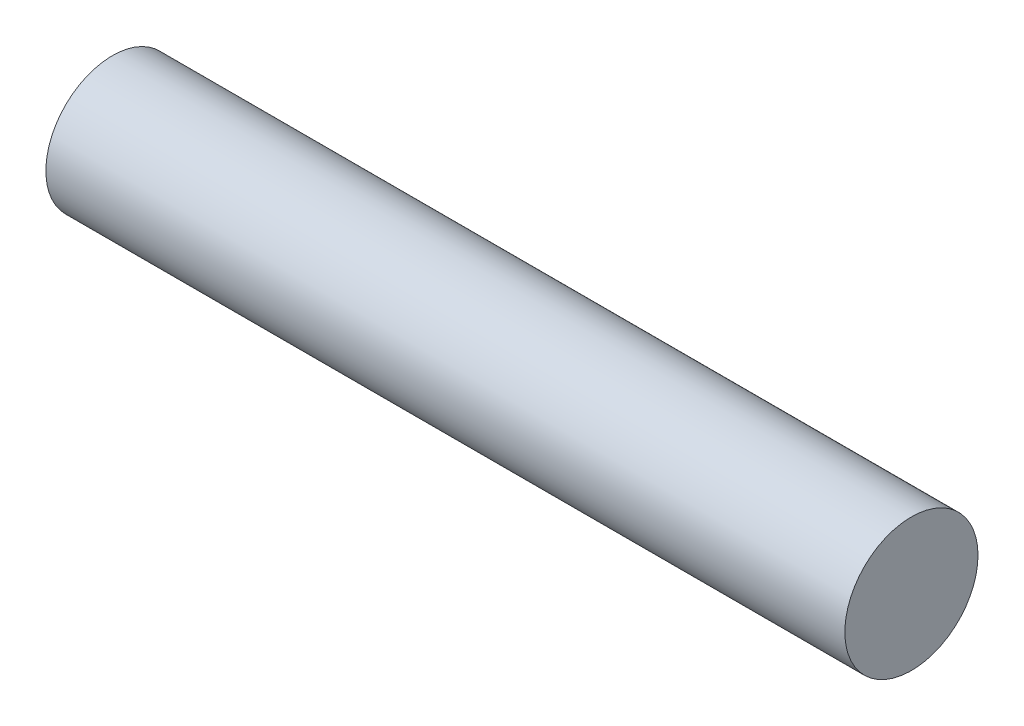
ISO-10303-21;
HEADER;
FILE_DESCRIPTION(('STEP AP214'),'2;1');
FILE_NAME('part.step','',(''),(''),'','','');
FILE_SCHEMA(('AUTOMOTIVE_DESIGN { 1 0 10303 214 1 1 1 1 }'));
ENDSEC;
DATA;
#1=APPLICATION_CONTEXT('core data for automotive mechanical design processes');
#2=APPLICATION_PROTOCOL_DEFINITION('international standard','automotive_design',2000,#1);
#3=PRODUCT_CONTEXT('',#1,'mechanical');
#4=PRODUCT('Part','Part','',(#3));
#5=PRODUCT_RELATED_PRODUCT_CATEGORY('part','',(#4));
#6=PRODUCT_DEFINITION_FORMATION('','',#4);
#7=PRODUCT_DEFINITION_CONTEXT('part definition',#1,'design');
#8=PRODUCT_DEFINITION('design','',#6,#7);
#9=PRODUCT_DEFINITION_SHAPE('','',#8);
#10=(LENGTH_UNIT() NAMED_UNIT(*) SI_UNIT(.MILLI.,.METRE.));
#11=(NAMED_UNIT(*) PLANE_ANGLE_UNIT() SI_UNIT($,.RADIAN.));
#12=(NAMED_UNIT(*) SI_UNIT($,.STERADIAN.) SOLID_ANGLE_UNIT());
#13=UNCERTAINTY_MEASURE_WITH_UNIT(LENGTH_MEASURE(1.E-05),#10,'distance_accuracy_value','');
#14=(GEOMETRIC_REPRESENTATION_CONTEXT(3) GLOBAL_UNCERTAINTY_ASSIGNED_CONTEXT((#13)) GLOBAL_UNIT_ASSIGNED_CONTEXT((#10,
#11,#12)) REPRESENTATION_CONTEXT('',''));
#15=CARTESIAN_POINT('',(0.,0.,0.));
#16=DIRECTION('',(0.,0.,1.));
#17=DIRECTION('',(1.,0.,0.));
#18=AXIS2_PLACEMENT_3D('',#15,#16,#17);
#19=CARTESIAN_POINT('',(38.1,0.,0.));
#20=DIRECTION('',(-1.,0.,0.));
#21=DIRECTION('',(0.,0.,1.));
#22=AXIS2_PLACEMENT_3D('',#19,#20,#21);
#23=CYLINDRICAL_SURFACE('',#22,3.175);
#24=CARTESIAN_POINT('',(38.1,0.,0.));
#25=DIRECTION('',(1.,0.,0.));
#26=DIRECTION('',(0.,0.,-1.));
#27=AXIS2_PLACEMENT_3D('',#24,#25,#26);
#28=CIRCLE('',#27,3.175);
#29=CARTESIAN_POINT('',(38.1,0.,-3.175));
#30=VERTEX_POINT('',#29);
#31=EDGE_CURVE('E10',#30,#30,#28,.T.);
#32=ORIENTED_EDGE('',*,*,#31,.F.);
#33=EDGE_LOOP('',(#32));
#34=FACE_BOUND('',#33,.T.);
#35=CARTESIAN_POINT('',(0.,0.,0.));
#36=DIRECTION('',(1.,0.,0.));
#37=DIRECTION('',(0.,0.,-1.));
#38=AXIS2_PLACEMENT_3D('',#35,#36,#37);
#39=CIRCLE('',#38,3.175);
#40=CARTESIAN_POINT('',(0.,0.,-3.175));
#41=VERTEX_POINT('',#40);
#42=EDGE_CURVE('E40',#41,#41,#39,.T.);
#43=ORIENTED_EDGE('',*,*,#42,.T.);
#44=EDGE_LOOP('',(#43));
#45=FACE_BOUND('',#44,.T.);
#46=ADVANCED_FACE('F37',(#34,#45),#23,.T.);
#47=CARTESIAN_POINT('',(38.1,0.,0.));
#48=DIRECTION('',(1.,0.,0.));
#49=DIRECTION('',(0.,0.,-1.));
#50=AXIS2_PLACEMENT_3D('',#47,#48,#49);
#51=PLANE('',#50);
#52=ORIENTED_EDGE('',*,*,#31,.T.);
#53=EDGE_LOOP('',(#52));
#54=FACE_BOUND('',#53,.T.);
#55=ADVANCED_FACE('F54',(#54),#51,.T.);
#56=CARTESIAN_POINT('',(0.,0.,0.));
#57=DIRECTION('',(1.,0.,0.));
#58=DIRECTION('',(0.,0.,-1.));
#59=AXIS2_PLACEMENT_3D('',#56,#57,#58);
#60=PLANE('',#59);
#61=ORIENTED_EDGE('',*,*,#42,.F.);
#62=EDGE_LOOP('',(#61));
#63=FACE_BOUND('',#62,.T.);
#64=ADVANCED_FACE('F52',(#63),#60,.F.);
#65=CLOSED_SHELL('',(#46,#55,#64));
#66=MANIFOLD_SOLID_BREP('B2',#65);
#67=ADVANCED_BREP_SHAPE_REPRESENTATION('',(#18,#66),#14);
#68=SHAPE_DEFINITION_REPRESENTATION(#9,#67);
ENDSEC;
END-ISO-10303-21;
